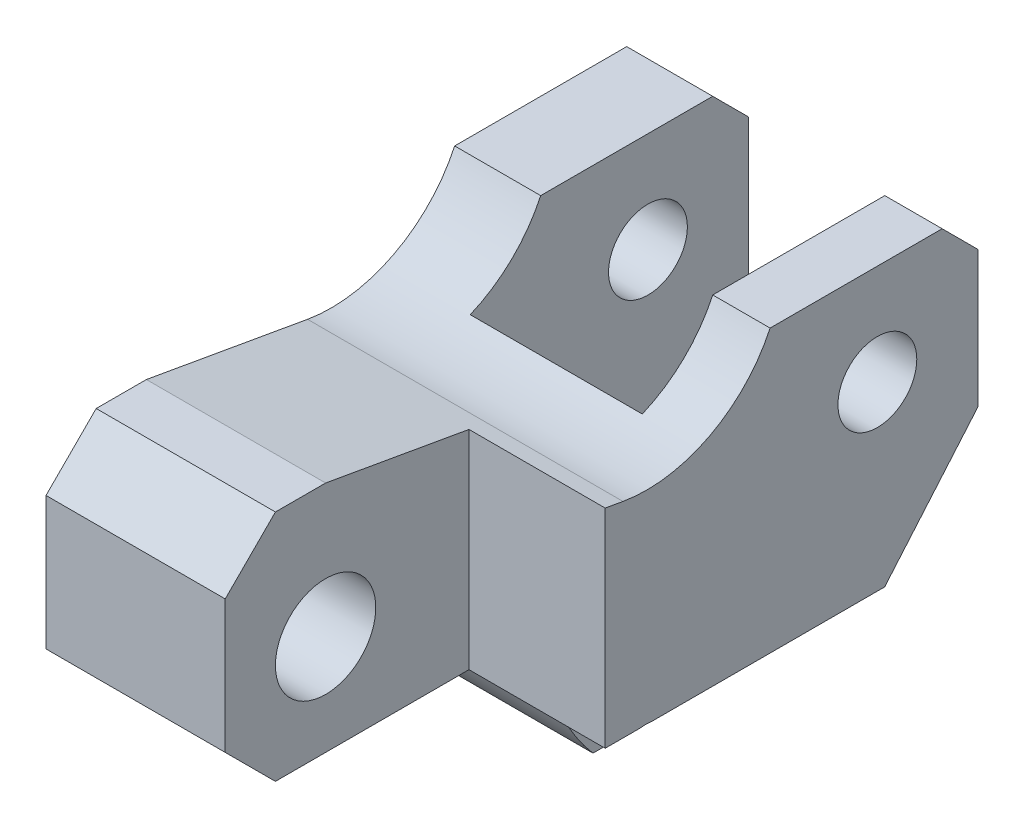
ISO-10303-21;
HEADER;
FILE_DESCRIPTION(('STEP AP214'),'2;1');
FILE_NAME('part.step','',(''),(''),'','','');
FILE_SCHEMA(('AUTOMOTIVE_DESIGN { 1 0 10303 214 1 1 1 1 }'));
ENDSEC;
DATA;
#1=APPLICATION_CONTEXT('core data for automotive mechanical design processes');
#2=APPLICATION_PROTOCOL_DEFINITION('international standard','automotive_design',2000,#1);
#3=PRODUCT_CONTEXT('',#1,'mechanical');
#4=PRODUCT('Part','Part','',(#3));
#5=PRODUCT_RELATED_PRODUCT_CATEGORY('part','',(#4));
#6=PRODUCT_DEFINITION_FORMATION('','',#4);
#7=PRODUCT_DEFINITION_CONTEXT('part definition',#1,'design');
#8=PRODUCT_DEFINITION('design','',#6,#7);
#9=PRODUCT_DEFINITION_SHAPE('','',#8);
#10=(LENGTH_UNIT() NAMED_UNIT(*) SI_UNIT(.MILLI.,.METRE.));
#11=(NAMED_UNIT(*) PLANE_ANGLE_UNIT() SI_UNIT($,.RADIAN.));
#12=(NAMED_UNIT(*) SI_UNIT($,.STERADIAN.) SOLID_ANGLE_UNIT());
#13=UNCERTAINTY_MEASURE_WITH_UNIT(LENGTH_MEASURE(1.E-05),#10,'distance_accuracy_value','');
#14=(GEOMETRIC_REPRESENTATION_CONTEXT(3) GLOBAL_UNCERTAINTY_ASSIGNED_CONTEXT((#13)) GLOBAL_UNIT_ASSIGNED_CONTEXT((#10,
#11,#12)) REPRESENTATION_CONTEXT('',''));
#15=CARTESIAN_POINT('',(0.,0.,0.));
#16=DIRECTION('',(0.,0.,1.));
#17=DIRECTION('',(1.,0.,0.));
#18=AXIS2_PLACEMENT_3D('',#15,#16,#17);
#19=CARTESIAN_POINT('',(22.,-39.,-16.2058823529412));
#20=DIRECTION('',(-1.,0.,0.));
#21=DIRECTION('',(0.,0.,1.));
#22=AXIS2_PLACEMENT_3D('',#19,#20,#21);
#23=CYLINDRICAL_SURFACE('',#22,29.);
#24=DIRECTION('',(-1.,0.,0.));
#25=VECTOR('',#24,1.);
#26=CARTESIAN_POINT('',(22.,-58.,5.70301994726546));
#27=LINE('',#26,#25);
#28=CARTESIAN_POINT('',(3.,-58.,5.70301994726546));
#29=VERTEX_POINT('',#28);
#30=CARTESIAN_POINT('',(-22.,-58.,5.70301994726546));
#31=VERTEX_POINT('',#30);
#32=EDGE_CURVE('E382',#29,#31,#27,.T.);
#33=ORIENTED_EDGE('',*,*,#32,.F.);
#34=CARTESIAN_POINT('',(3.,-39.,-16.2058823529412));
#35=DIRECTION('',(1.,0.,0.));
#36=DIRECTION('',(0.,0.,-1.));
#37=AXIS2_PLACEMENT_3D('',#34,#35,#36);
#38=CIRCLE('',#37,29.);
#39=CARTESIAN_POINT('',(3.,-43.4386963418157,12.4524144349901));
#40=VERTEX_POINT('',#39);
#41=EDGE_CURVE('E573',#29,#40,#38,.F.);
#42=ORIENTED_EDGE('',*,*,#41,.T.);
#43=DIRECTION('',(-1.,0.,0.));
#44=VECTOR('',#43,1.);
#45=CARTESIAN_POINT('',(22.,-43.4386963418157,12.4524144349901));
#46=LINE('',#45,#44);
#47=CARTESIAN_POINT('',(-22.,-43.4386963418157,12.4524144349901));
#48=VERTEX_POINT('',#47);
#49=EDGE_CURVE('E379',#40,#48,#46,.T.);
#50=ORIENTED_EDGE('',*,*,#49,.T.);
#51=CARTESIAN_POINT('',(-22.,-39.,-16.2058823529412));
#52=DIRECTION('',(-1.,0.,0.));
#53=DIRECTION('',(0.,0.,1.));
#54=AXIS2_PLACEMENT_3D('',#51,#52,#53);
#55=CIRCLE('',#54,29.);
#56=EDGE_CURVE('E332',#31,#48,#55,.T.);
#57=ORIENTED_EDGE('',*,*,#56,.F.);
#58=EDGE_LOOP('',(#33,#42,#50,#57));
#59=FACE_BOUND('',#58,.T.);
#60=ADVANCED_FACE('F99',(#59),#23,.T.);
#61=CARTESIAN_POINT('',(22.,-58.,0.));
#62=DIRECTION('',(0.,-1.,0.));
#63=DIRECTION('',(0.,0.,-1.));
#64=AXIS2_PLACEMENT_3D('',#61,#62,#63);
#65=PLANE('',#64);
#66=DIRECTION('',(-1.,0.,0.));
#67=VECTOR('',#66,1.);
#68=CARTESIAN_POINT('',(22.,-58.,0.));
#69=LINE('',#68,#67);
#70=CARTESIAN_POINT('',(3.,-58.,0.));
#71=VERTEX_POINT('',#70);
#72=CARTESIAN_POINT('',(-22.,-58.,0.));
#73=VERTEX_POINT('',#72);
#74=EDGE_CURVE('E385',#71,#73,#69,.T.);
#75=ORIENTED_EDGE('',*,*,#74,.F.);
#76=DIRECTION('',(0.,0.,1.));
#77=VECTOR('',#76,1.);
#78=CARTESIAN_POINT('',(3.,-58.,0.));
#79=LINE('',#78,#77);
#80=EDGE_CURVE('E115',#71,#29,#79,.T.);
#81=ORIENTED_EDGE('',*,*,#80,.T.);
#82=ORIENTED_EDGE('',*,*,#32,.T.);
#83=DIRECTION('',(0.,0.,1.));
#84=VECTOR('',#83,1.);
#85=CARTESIAN_POINT('',(-22.,-58.,0.));
#86=LINE('',#85,#84);
#87=EDGE_CURVE('E328',#73,#31,#86,.T.);
#88=ORIENTED_EDGE('',*,*,#87,.F.);
#89=EDGE_LOOP('',(#75,#81,#82,#88));
#90=FACE_BOUND('',#89,.T.);
#91=ADVANCED_FACE('F585',(#90),#65,.T.);
#92=CARTESIAN_POINT('',(22.,-5.,-29.));
#93=DIRECTION('',(0.,0.,-1.));
#94=DIRECTION('',(0.,1.,0.));
#95=AXIS2_PLACEMENT_3D('',#92,#93,#94);
#96=PLANE('',#95);
#97=DIRECTION('',(-1.,0.,0.));
#98=VECTOR('',#97,1.);
#99=CARTESIAN_POINT('',(22.,-5.,-29.));
#100=LINE('',#99,#98);
#101=CARTESIAN_POINT('',(-10.,-5.,-29.));
#102=VERTEX_POINT('',#101);
#103=CARTESIAN_POINT('',(-22.,-5.,-29.));
#104=VERTEX_POINT('',#103);
#105=EDGE_CURVE('E395',#102,#104,#100,.T.);
#106=ORIENTED_EDGE('',*,*,#105,.F.);
#107=DIRECTION('',(0.,-1.,0.));
#108=VECTOR('',#107,1.);
#109=CARTESIAN_POINT('',(-10.,-5.,-29.));
#110=LINE('',#109,#108);
#111=CARTESIAN_POINT('',(-10.,-24.,-29.));
#112=VERTEX_POINT('',#111);
#113=EDGE_CURVE('E464',#102,#112,#110,.T.);
#114=ORIENTED_EDGE('',*,*,#113,.T.);
#115=DIRECTION('',(-1.,0.,0.));
#116=VECTOR('',#115,1.);
#117=CARTESIAN_POINT('',(22.,-24.,-29.));
#118=LINE('',#117,#116);
#119=CARTESIAN_POINT('',(-22.,-24.,-29.));
#120=VERTEX_POINT('',#119);
#121=EDGE_CURVE('E390',#112,#120,#118,.T.);
#122=ORIENTED_EDGE('',*,*,#121,.T.);
#123=DIRECTION('',(0.,-1.,0.));
#124=VECTOR('',#123,1.);
#125=CARTESIAN_POINT('',(-22.,-5.,-29.));
#126=LINE('',#125,#124);
#127=EDGE_CURVE('E320',#104,#120,#126,.T.);
#128=ORIENTED_EDGE('',*,*,#127,.F.);
#129=EDGE_LOOP('',(#106,#114,#122,#128));
#130=FACE_BOUND('',#129,.T.);
#131=ADVANCED_FACE('F598',(#130),#96,.T.);
#132=CARTESIAN_POINT('',(22.,0.,-24.));
#133=DIRECTION('',(0.,0.707106781186546,-0.707106781186549));
#134=DIRECTION('',(0.,0.707106781186549,0.707106781186546));
#135=AXIS2_PLACEMENT_3D('',#132,#133,#134);
#136=PLANE('',#135);
#137=DIRECTION('',(-1.,0.,0.));
#138=VECTOR('',#137,1.);
#139=CARTESIAN_POINT('',(22.,0.,-24.));
#140=LINE('',#139,#138);
#141=CARTESIAN_POINT('',(-10.,0.,-24.));
#142=VERTEX_POINT('',#141);
#143=CARTESIAN_POINT('',(-22.,0.,-24.));
#144=VERTEX_POINT('',#143);
#145=EDGE_CURVE('E400',#142,#144,#140,.T.);
#146=ORIENTED_EDGE('',*,*,#145,.F.);
#147=DIRECTION('',(0.,-0.707106781186549,-0.707106781186546));
#148=VECTOR('',#147,1.);
#149=CARTESIAN_POINT('',(-10.,0.,-24.));
#150=LINE('',#149,#148);
#151=EDGE_CURVE('E460',#142,#102,#150,.T.);
#152=ORIENTED_EDGE('',*,*,#151,.T.);
#153=ORIENTED_EDGE('',*,*,#105,.T.);
#154=DIRECTION('',(0.,-0.707106781186549,-0.707106781186546));
#155=VECTOR('',#154,1.);
#156=CARTESIAN_POINT('',(-22.,0.,-24.));
#157=LINE('',#156,#155);
#158=EDGE_CURVE('E316',#144,#104,#157,.T.);
#159=ORIENTED_EDGE('',*,*,#158,.F.);
#160=EDGE_LOOP('',(#146,#152,#153,#159));
#161=FACE_BOUND('',#160,.T.);
#162=ADVANCED_FACE('F648',(#161),#136,.T.);
#163=CARTESIAN_POINT('',(22.,0.,0.));
#164=DIRECTION('',(0.,1.,0.));
#165=DIRECTION('',(0.,0.,1.));
#166=AXIS2_PLACEMENT_3D('',#163,#164,#165);
#167=PLANE('',#166);
#168=DIRECTION('',(-1.,0.,0.));
#169=VECTOR('',#168,1.);
#170=CARTESIAN_POINT('',(22.,0.,0.));
#171=LINE('',#170,#169);
#172=CARTESIAN_POINT('',(-10.,0.,0.));
#173=VERTEX_POINT('',#172);
#174=CARTESIAN_POINT('',(-22.,0.,0.));
#175=VERTEX_POINT('',#174);
#176=EDGE_CURVE('E405',#173,#175,#171,.T.);
#177=ORIENTED_EDGE('',*,*,#176,.F.);
#178=DIRECTION('',(0.,0.,-1.));
#179=VECTOR('',#178,1.);
#180=CARTESIAN_POINT('',(-10.,0.,0.));
#181=LINE('',#180,#179);
#182=EDGE_CURVE('E122',#173,#142,#181,.T.);
#183=ORIENTED_EDGE('',*,*,#182,.T.);
#184=ORIENTED_EDGE('',*,*,#145,.T.);
#185=DIRECTION('',(0.,0.,-1.));
#186=VECTOR('',#185,1.);
#187=CARTESIAN_POINT('',(-22.,0.,0.));
#188=LINE('',#187,#186);
#189=EDGE_CURVE('E312',#175,#144,#188,.T.);
#190=ORIENTED_EDGE('',*,*,#189,.F.);
#191=EDGE_LOOP('',(#177,#183,#184,#190));
#192=FACE_BOUND('',#191,.T.);
#193=ADVANCED_FACE('F605',(#192),#167,.T.);
#194=CARTESIAN_POINT('',(-24.,-14.,-14.9628500451671));
#195=DIRECTION('',(1.,0.,0.));
#196=DIRECTION('',(0.,0.,-1.));
#197=AXIS2_PLACEMENT_3D('',#194,#195,#196);
#198=CYLINDRICAL_SURFACE('',#197,5.5);
#199=CARTESIAN_POINT('',(-22.,-14.,-14.9628500451671));
#200=DIRECTION('',(1.,0.,0.));
#201=DIRECTION('',(0.,0.,-1.));
#202=AXIS2_PLACEMENT_3D('',#199,#200,#201);
#203=CIRCLE('',#202,5.5);
#204=CARTESIAN_POINT('',(-22.,-14.,-20.4628500451671));
#205=VERTEX_POINT('',#204);
#206=EDGE_CURVE('E408',#205,#205,#203,.T.);
#207=ORIENTED_EDGE('',*,*,#206,.F.);
#208=EDGE_LOOP('',(#207));
#209=FACE_BOUND('',#208,.T.);
#210=CARTESIAN_POINT('',(-10.,-14.,-14.9628500451671));
#211=DIRECTION('',(1.,0.,0.));
#212=DIRECTION('',(0.,0.,-1.));
#213=AXIS2_PLACEMENT_3D('',#210,#211,#212);
#214=CIRCLE('',#213,5.5);
#215=CARTESIAN_POINT('',(-10.,-14.,-20.4628500451671));
#216=VERTEX_POINT('',#215);
#217=EDGE_CURVE('E419',#216,#216,#214,.F.);
#218=ORIENTED_EDGE('',*,*,#217,.F.);
#219=EDGE_LOOP('',(#218));
#220=FACE_BOUND('',#219,.T.);
#221=ADVANCED_FACE('F663',(#209,#220),#198,.F.);
#222=CARTESIAN_POINT('',(22.,8.02974697307312,17.2198479536964));
#223=DIRECTION('',(1.,0.,0.));
#224=DIRECTION('',(0.,0.,-1.));
#225=AXIS2_PLACEMENT_3D('',#222,#223,#224);
#226=PLANE('',#225);
#227=DIRECTION('',(0.,0.,1.));
#228=VECTOR('',#227,1.);
#229=CARTESIAN_POINT('',(22.,-39.2629031614509,23.));
#230=LINE('',#229,#228);
#231=CARTESIAN_POINT('',(22.,-39.2629031614509,-15.9816414211154));
#232=VERTEX_POINT('',#231);
#233=CARTESIAN_POINT('',(22.,-39.2629031614509,16.6282076153549));
#234=VERTEX_POINT('',#233);
#235=EDGE_CURVE('E263',#232,#234,#230,.T.);
#236=ORIENTED_EDGE('',*,*,#235,.F.);
#237=DIRECTION('',(0.,-0.760833951959086,0.64894660608275));
#238=VECTOR('',#237,1.);
#239=CARTESIAN_POINT('',(22.,-24.,-29.));
#240=LINE('',#239,#238);
#241=CARTESIAN_POINT('',(22.,-24.,-29.));
#242=VERTEX_POINT('',#241);
#243=EDGE_CURVE('E278',#242,#232,#240,.T.);
#244=ORIENTED_EDGE('',*,*,#243,.F.);
#245=DIRECTION('',(0.,-1.,0.));
#246=VECTOR('',#245,1.);
#247=CARTESIAN_POINT('',(22.,-5.,-29.));
#248=LINE('',#247,#246);
#249=CARTESIAN_POINT('',(22.,-5.,-29.));
#250=VERTEX_POINT('',#249);
#251=EDGE_CURVE('E289',#250,#242,#248,.T.);
#252=ORIENTED_EDGE('',*,*,#251,.F.);
#253=DIRECTION('',(0.,-0.707106781186549,-0.707106781186546));
#254=VECTOR('',#253,1.);
#255=CARTESIAN_POINT('',(22.,0.,-24.));
#256=LINE('',#255,#254);
#257=CARTESIAN_POINT('',(22.,0.,-24.));
#258=VERTEX_POINT('',#257);
#259=EDGE_CURVE('E295',#258,#250,#256,.T.);
#260=ORIENTED_EDGE('',*,*,#259,.F.);
#261=DIRECTION('',(0.,0.,-1.));
#262=VECTOR('',#261,1.);
#263=CARTESIAN_POINT('',(22.,0.,0.));
#264=LINE('',#263,#262);
#265=CARTESIAN_POINT('',(22.,0.,0.));
#266=VERTEX_POINT('',#265);
#267=EDGE_CURVE('E531',#266,#258,#264,.T.);
#268=ORIENTED_EDGE('',*,*,#267,.F.);
#269=CARTESIAN_POINT('',(22.,8.02974697307312,17.2198479536964));
#270=DIRECTION('',(1.,0.,0.));
#271=DIRECTION('',(0.,0.,-1.));
#272=AXIS2_PLACEMENT_3D('',#269,#270,#271);
#273=CIRCLE('',#272,19.);
#274=CARTESIAN_POINT('',(22.,-10.6816003341589,20.519163329368));
#275=VERTEX_POINT('',#274);
#276=EDGE_CURVE('E527',#275,#266,#273,.T.);
#277=ORIENTED_EDGE('',*,*,#276,.F.);
#278=DIRECTION('',(0.,-0.173648177666924,-0.984807753012209));
#279=VECTOR('',#278,1.);
#280=CARTESIAN_POINT('',(22.,-6.71762228022635,43.));
#281=LINE('',#280,#279);
#282=CARTESIAN_POINT('',(22.,-10.2441618943955,23.));
#283=VERTEX_POINT('',#282);
#284=EDGE_CURVE('E360',#283,#275,#281,.T.);
#285=ORIENTED_EDGE('',*,*,#284,.F.);
#286=DIRECTION('',(0.,-1.,0.));
#287=VECTOR('',#286,1.);
#288=CARTESIAN_POINT('',(22.,-6.66579614244174,23.));
#289=LINE('',#288,#287);
#290=CARTESIAN_POINT('',(22.,-39.2629031614509,23.));
#291=VERTEX_POINT('',#290);
#292=EDGE_CURVE('E487',#283,#291,#289,.T.);
#293=ORIENTED_EDGE('',*,*,#292,.T.);
#294=DIRECTION('',(0.,0.,1.));
#295=VECTOR('',#294,1.);
#296=CARTESIAN_POINT('',(22.,-39.2629031614509,18.1587925608085));
#297=LINE('',#296,#295);
#298=CARTESIAN_POINT('',(22.,-39.2629031614509,18.1587925608085));
#299=VERTEX_POINT('',#298);
#300=EDGE_CURVE('E293',#299,#291,#297,.T.);
#301=ORIENTED_EDGE('',*,*,#300,.F.);
#302=CARTESIAN_POINT('',(22.,-44.2039888145425,17.3935000880817));
#303=DIRECTION('',(1.,0.,0.));
#304=DIRECTION('',(0.,0.,-1.));
#305=AXIS2_PLACEMENT_3D('',#302,#303,#304);
#306=CIRCLE('',#305,5.);
#307=EDGE_CURVE('E281',#234,#299,#306,.T.);
#308=ORIENTED_EDGE('',*,*,#307,.F.);
#309=EDGE_LOOP('',(#236,#244,#252,#260,#268,#277,#285,#293,#301,#308));
#310=FACE_BOUND('',#309,.T.);
#311=CARTESIAN_POINT('',(22.,-14.,-14.9628500451671));
#312=DIRECTION('',(1.,0.,0.));
#313=DIRECTION('',(0.,0.,-1.));
#314=AXIS2_PLACEMENT_3D('',#311,#312,#313);
#315=CIRCLE('',#314,5.5);
#316=CARTESIAN_POINT('',(22.,-14.,-20.4628500451671));
#317=VERTEX_POINT('',#316);
#318=EDGE_CURVE('E412',#317,#317,#315,.T.);
#319=ORIENTED_EDGE('',*,*,#318,.F.);
#320=EDGE_LOOP('',(#319));
#321=FACE_BOUND('',#320,.T.);
#322=ADVANCED_FACE('F275',(#310,#321),#226,.T.);
#323=CARTESIAN_POINT('',(22.,-6.71762228022635,43.));
#324=DIRECTION('',(0.,0.984807753012209,-0.173648177666924));
#325=DIRECTION('',(0.,0.173648177666924,0.984807753012209));
#326=AXIS2_PLACEMENT_3D('',#323,#324,#325);
#327=PLANE('',#326);
#328=DIRECTION('',(0.,0.173648177666924,0.984807753012209));
#329=VECTOR('',#328,1.);
#330=CARTESIAN_POINT('',(3.,-6.71762228022635,43.));
#331=LINE('',#330,#329);
#332=CARTESIAN_POINT('',(3.,-10.2441618943955,23.));
#333=VERTEX_POINT('',#332);
#334=CARTESIAN_POINT('',(3.,-6.71762228022635,43.));
#335=VERTEX_POINT('',#334);
#336=EDGE_CURVE('E512',#333,#335,#331,.T.);
#337=ORIENTED_EDGE('',*,*,#336,.F.);
#338=DIRECTION('',(1.,0.,0.));
#339=VECTOR('',#338,1.);
#340=CARTESIAN_POINT('',(22.,-10.2441618943955,23.));
#341=LINE('',#340,#339);
#342=EDGE_CURVE('E515',#333,#283,#341,.T.);
#343=ORIENTED_EDGE('',*,*,#342,.T.);
#344=ORIENTED_EDGE('',*,*,#284,.T.);
#345=DIRECTION('',(-1.,0.,0.));
#346=VECTOR('',#345,1.);
#347=CARTESIAN_POINT('',(22.,-10.6816003341589,20.519163329368));
#348=LINE('',#347,#346);
#349=CARTESIAN_POINT('',(-22.,-10.6816003341589,20.519163329368));
#350=VERTEX_POINT('',#349);
#351=EDGE_CURVE('E302',#275,#350,#348,.T.);
#352=ORIENTED_EDGE('',*,*,#351,.T.);
#353=DIRECTION('',(0.,-0.173648177666924,-0.984807753012209));
#354=VECTOR('',#353,1.);
#355=CARTESIAN_POINT('',(-22.,-6.71762228022635,43.));
#356=LINE('',#355,#354);
#357=CARTESIAN_POINT('',(-22.,-6.71762228022635,43.));
#358=VERTEX_POINT('',#357);
#359=EDGE_CURVE('E303',#358,#350,#356,.T.);
#360=ORIENTED_EDGE('',*,*,#359,.F.);
#361=DIRECTION('',(-1.,0.,0.));
#362=VECTOR('',#361,1.);
#363=CARTESIAN_POINT('',(22.,-6.71762228022635,43.));
#364=LINE('',#363,#362);
#365=EDGE_CURVE('E361',#335,#358,#364,.T.);
#366=ORIENTED_EDGE('',*,*,#365,.F.);
#367=EDGE_LOOP('',(#337,#343,#344,#352,#360,#366));
#368=FACE_BOUND('',#367,.T.);
#369=ADVANCED_FACE('F101',(#368),#327,.T.);
#370=CARTESIAN_POINT('',(22.,-39.2629031614509,18.1587925608085));
#371=DIRECTION('',(0.,-1.,0.));
#372=DIRECTION('',(0.,0.,-1.));
#373=AXIS2_PLACEMENT_3D('',#370,#371,#372);
#374=PLANE('',#373);
#375=DIRECTION('',(1.,0.,0.));
#376=VECTOR('',#375,1.);
#377=CARTESIAN_POINT('',(3.,-39.2629031614509,23.));
#378=LINE('',#377,#376);
#379=CARTESIAN_POINT('',(3.,-39.2629031614509,23.));
#380=VERTEX_POINT('',#379);
#381=EDGE_CURVE('E418',#380,#291,#378,.T.);
#382=ORIENTED_EDGE('',*,*,#381,.F.);
#383=DIRECTION('',(0.,0.,-1.));
#384=VECTOR('',#383,1.);
#385=CARTESIAN_POINT('',(3.,-39.2629031614509,57.0590779506768));
#386=LINE('',#385,#384);
#387=CARTESIAN_POINT('',(3.,-39.2629031614509,50.));
#388=VERTEX_POINT('',#387);
#389=EDGE_CURVE('E488',#388,#380,#386,.T.);
#390=ORIENTED_EDGE('',*,*,#389,.F.);
#391=DIRECTION('',(-1.,0.,0.));
#392=VECTOR('',#391,1.);
#393=CARTESIAN_POINT('',(22.,-39.2629031614509,50.));
#394=LINE('',#393,#392);
#395=CARTESIAN_POINT('',(-22.,-39.2629031614509,50.));
#396=VERTEX_POINT('',#395);
#397=EDGE_CURVE('E373',#388,#396,#394,.T.);
#398=ORIENTED_EDGE('',*,*,#397,.T.);
#399=DIRECTION('',(0.,0.,1.));
#400=VECTOR('',#399,1.);
#401=CARTESIAN_POINT('',(-22.,-39.2629031614509,18.1587925608085));
#402=LINE('',#401,#400);
#403=CARTESIAN_POINT('',(-22.,-39.2629031614509,18.1587925608085));
#404=VERTEX_POINT('',#403);
#405=EDGE_CURVE('E340',#404,#396,#402,.T.);
#406=ORIENTED_EDGE('',*,*,#405,.F.);
#407=DIRECTION('',(-1.,0.,0.));
#408=VECTOR('',#407,1.);
#409=CARTESIAN_POINT('',(22.,-39.2629031614509,18.1587925608085));
#410=LINE('',#409,#408);
#411=EDGE_CURVE('E376',#299,#404,#410,.T.);
#412=ORIENTED_EDGE('',*,*,#411,.F.);
#413=ORIENTED_EDGE('',*,*,#300,.T.);
#414=EDGE_LOOP('',(#382,#390,#398,#406,#412,#413));
#415=FACE_BOUND('',#414,.T.);
#416=ADVANCED_FACE('F562',(#415),#374,.T.);
#417=CARTESIAN_POINT('',(-22.,8.02974697307312,17.2198479536964));
#418=DIRECTION('',(1.,0.,0.));
#419=DIRECTION('',(0.,0.,-1.));
#420=AXIS2_PLACEMENT_3D('',#417,#418,#419);
#421=PLANE('',#420);
#422=ORIENTED_EDGE('',*,*,#206,.T.);
#423=EDGE_LOOP('',(#422));
#424=FACE_BOUND('',#423,.T.);
#425=ORIENTED_EDGE('',*,*,#359,.T.);
#426=CARTESIAN_POINT('',(-22.,8.02974697307312,17.2198479536964));
#427=DIRECTION('',(1.,0.,0.));
#428=DIRECTION('',(0.,0.,-1.));
#429=AXIS2_PLACEMENT_3D('',#426,#427,#428);
#430=CIRCLE('',#429,19.);
#431=EDGE_CURVE('E307',#350,#175,#430,.T.);
#432=ORIENTED_EDGE('',*,*,#431,.T.);
#433=ORIENTED_EDGE('',*,*,#189,.T.);
#434=ORIENTED_EDGE('',*,*,#158,.T.);
#435=ORIENTED_EDGE('',*,*,#127,.T.);
#436=DIRECTION('',(0.,-0.760833951959086,0.64894660608275));
#437=VECTOR('',#436,1.);
#438=CARTESIAN_POINT('',(-22.,-24.,-29.));
#439=LINE('',#438,#437);
#440=EDGE_CURVE('E324',#120,#73,#439,.T.);
#441=ORIENTED_EDGE('',*,*,#440,.T.);
#442=ORIENTED_EDGE('',*,*,#87,.T.);
#443=ORIENTED_EDGE('',*,*,#56,.T.);
#444=CARTESIAN_POINT('',(-22.,-44.2039888145425,17.3935000880817));
#445=DIRECTION('',(1.,0.,0.));
#446=DIRECTION('',(0.,0.,-1.));
#447=AXIS2_PLACEMENT_3D('',#444,#445,#446);
#448=CIRCLE('',#447,5.);
#449=EDGE_CURVE('E336',#48,#404,#448,.T.);
#450=ORIENTED_EDGE('',*,*,#449,.T.);
#451=ORIENTED_EDGE('',*,*,#405,.T.);
#452=DIRECTION('',(0.,0.707106781186549,0.707106781186546));
#453=VECTOR('',#452,1.);
#454=CARTESIAN_POINT('',(-22.,-39.2629031614509,50.));
#455=LINE('',#454,#453);
#456=CARTESIAN_POINT('',(-22.,-32.2629031614509,57.));
#457=VERTEX_POINT('',#456);
#458=EDGE_CURVE('E344',#396,#457,#455,.T.);
#459=ORIENTED_EDGE('',*,*,#458,.T.);
#460=DIRECTION('',(0.,1.,0.));
#461=VECTOR('',#460,1.);
#462=CARTESIAN_POINT('',(-22.,-32.2629031614509,57.));
#463=LINE('',#462,#461);
#464=CARTESIAN_POINT('',(-22.,-13.7176222802264,57.));
#465=VERTEX_POINT('',#464);
#466=EDGE_CURVE('E348',#457,#465,#463,.T.);
#467=ORIENTED_EDGE('',*,*,#466,.T.);
#468=DIRECTION('',(0.,0.707106781186549,-0.707106781186546));
#469=VECTOR('',#468,1.);
#470=CARTESIAN_POINT('',(-22.,-13.7176222802264,57.));
#471=LINE('',#470,#469);
#472=CARTESIAN_POINT('',(-22.,-6.71762228022635,50.));
#473=VERTEX_POINT('',#472);
#474=EDGE_CURVE('E352',#465,#473,#471,.T.);
#475=ORIENTED_EDGE('',*,*,#474,.T.);
#476=DIRECTION('',(0.,0.,1.));
#477=VECTOR('',#476,1.);
#478=CARTESIAN_POINT('',(-22.,-6.71762228022635,43.));
#479=LINE('',#478,#477);
#480=EDGE_CURVE('E356',#358,#473,#479,.T.);
#481=ORIENTED_EDGE('',*,*,#480,.F.);
#482=EDGE_LOOP('',(#425,#432,#433,#434,#435,#441,#442,#443,#450,#451,#459,#467,#475,#481));
#483=FACE_BOUND('',#482,.T.);
#484=CARTESIAN_POINT('',(-22.,-25.2629031614509,43.));
#485=DIRECTION('',(1.,0.,0.));
#486=DIRECTION('',(0.,0.,-1.));
#487=AXIS2_PLACEMENT_3D('',#484,#485,#486);
#488=CIRCLE('',#487,7.);
#489=CARTESIAN_POINT('',(-22.,-25.2629031614509,36.));
#490=VERTEX_POINT('',#489);
#491=EDGE_CURVE('E308',#490,#490,#488,.T.);
#492=ORIENTED_EDGE('',*,*,#491,.T.);
#493=EDGE_LOOP('',(#492));
#494=FACE_BOUND('',#493,.T.);
#495=ADVANCED_FACE('F593',(#424,#483,#494),#421,.F.);
#496=CARTESIAN_POINT('',(22.,-6.71762228022635,43.));
#497=DIRECTION('',(0.,-1.,0.));
#498=DIRECTION('',(0.,0.,-1.));
#499=AXIS2_PLACEMENT_3D('',#496,#497,#498);
#500=PLANE('',#499);
#501=DIRECTION('',(-1.,0.,0.));
#502=VECTOR('',#501,1.);
#503=CARTESIAN_POINT('',(22.,-6.71762228022635,50.));
#504=LINE('',#503,#502);
#505=CARTESIAN_POINT('',(3.,-6.71762228022635,50.));
#506=VERTEX_POINT('',#505);
#507=EDGE_CURVE('E364',#506,#473,#504,.T.);
#508=ORIENTED_EDGE('',*,*,#507,.F.);
#509=DIRECTION('',(0.,0.,-1.));
#510=VECTOR('',#509,1.);
#511=CARTESIAN_POINT('',(3.,-6.71762228022635,43.));
#512=LINE('',#511,#510);
#513=EDGE_CURVE('E508',#506,#335,#512,.T.);
#514=ORIENTED_EDGE('',*,*,#513,.T.);
#515=ORIENTED_EDGE('',*,*,#365,.T.);
#516=ORIENTED_EDGE('',*,*,#480,.T.);
#517=EDGE_LOOP('',(#508,#514,#515,#516));
#518=FACE_BOUND('',#517,.T.);
#519=ADVANCED_FACE('F610',(#518),#500,.F.);
#520=CARTESIAN_POINT('',(22.,-13.7176222802264,57.));
#521=DIRECTION('',(0.,0.707106781186546,0.707106781186549));
#522=DIRECTION('',(0.,-0.707106781186549,0.707106781186546));
#523=AXIS2_PLACEMENT_3D('',#520,#521,#522);
#524=PLANE('',#523);
#525=DIRECTION('',(0.,-0.707106781186549,0.707106781186546));
#526=VECTOR('',#525,1.);
#527=CARTESIAN_POINT('',(3.,-13.7176222802264,57.));
#528=LINE('',#527,#526);
#529=CARTESIAN_POINT('',(3.,-13.7176222802264,57.));
#530=VERTEX_POINT('',#529);
#531=EDGE_CURVE('E505',#506,#530,#528,.T.);
#532=ORIENTED_EDGE('',*,*,#531,.F.);
#533=ORIENTED_EDGE('',*,*,#507,.T.);
#534=ORIENTED_EDGE('',*,*,#474,.F.);
#535=DIRECTION('',(-1.,0.,0.));
#536=VECTOR('',#535,1.);
#537=CARTESIAN_POINT('',(22.,-13.7176222802264,57.));
#538=LINE('',#537,#536);
#539=EDGE_CURVE('E367',#530,#465,#538,.T.);
#540=ORIENTED_EDGE('',*,*,#539,.F.);
#541=EDGE_LOOP('',(#532,#533,#534,#540));
#542=FACE_BOUND('',#541,.T.);
#543=ADVANCED_FACE('F615',(#542),#524,.T.);
#544=CARTESIAN_POINT('',(22.,-32.2629031614509,57.));
#545=DIRECTION('',(0.,0.,1.));
#546=DIRECTION('',(0.,-1.,0.));
#547=AXIS2_PLACEMENT_3D('',#544,#545,#546);
#548=PLANE('',#547);
#549=DIRECTION('',(0.,-1.,0.));
#550=VECTOR('',#549,1.);
#551=CARTESIAN_POINT('',(3.,-32.2629031614509,57.));
#552=LINE('',#551,#550);
#553=CARTESIAN_POINT('',(3.,-32.2629031614509,57.));
#554=VERTEX_POINT('',#553);
#555=EDGE_CURVE('E502',#530,#554,#552,.T.);
#556=ORIENTED_EDGE('',*,*,#555,.F.);
#557=ORIENTED_EDGE('',*,*,#539,.T.);
#558=ORIENTED_EDGE('',*,*,#466,.F.);
#559=DIRECTION('',(-1.,0.,0.));
#560=VECTOR('',#559,1.);
#561=CARTESIAN_POINT('',(22.,-32.2629031614509,57.));
#562=LINE('',#561,#560);
#563=EDGE_CURVE('E370',#554,#457,#562,.T.);
#564=ORIENTED_EDGE('',*,*,#563,.F.);
#565=EDGE_LOOP('',(#556,#557,#558,#564));
#566=FACE_BOUND('',#565,.T.);
#567=ADVANCED_FACE('F619',(#566),#548,.T.);
#568=CARTESIAN_POINT('',(22.,-39.2629031614509,50.));
#569=DIRECTION('',(0.,-0.707106781186547,0.707106781186549));
#570=DIRECTION('',(0.,-0.707106781186549,-0.707106781186546));
#571=AXIS2_PLACEMENT_3D('',#568,#569,#570);
#572=PLANE('',#571);
#573=DIRECTION('',(0.,-0.707106781186549,-0.707106781186546));
#574=VECTOR('',#573,1.);
#575=CARTESIAN_POINT('',(3.,-39.2629031614509,50.));
#576=LINE('',#575,#574);
#577=EDGE_CURVE('E417',#554,#388,#576,.T.);
#578=ORIENTED_EDGE('',*,*,#577,.F.);
#579=ORIENTED_EDGE('',*,*,#563,.T.);
#580=ORIENTED_EDGE('',*,*,#458,.F.);
#581=ORIENTED_EDGE('',*,*,#397,.F.);
#582=EDGE_LOOP('',(#578,#579,#580,#581));
#583=FACE_BOUND('',#582,.T.);
#584=ADVANCED_FACE('F622',(#583),#572,.T.);
#585=CARTESIAN_POINT('',(22.,-44.2039888145425,17.3935000880817));
#586=DIRECTION('',(-1.,0.,0.));
#587=DIRECTION('',(0.,0.,1.));
#588=AXIS2_PLACEMENT_3D('',#585,#586,#587);
#589=CYLINDRICAL_SURFACE('',#588,5.);
#590=DIRECTION('',(-1.,0.,0.));
#591=VECTOR('',#590,1.);
#592=CARTESIAN_POINT('',(22.,-39.2629031614509,16.6282076153549));
#593=LINE('',#592,#591);
#594=CARTESIAN_POINT('',(3.,-39.2629031614509,16.6282076153549));
#595=VERTEX_POINT('',#594);
#596=EDGE_CURVE('E270',#234,#595,#593,.T.);
#597=ORIENTED_EDGE('',*,*,#596,.F.);
#598=ORIENTED_EDGE('',*,*,#307,.T.);
#599=ORIENTED_EDGE('',*,*,#411,.T.);
#600=ORIENTED_EDGE('',*,*,#449,.F.);
#601=ORIENTED_EDGE('',*,*,#49,.F.);
#602=CARTESIAN_POINT('',(3.,-44.2039888145425,17.3935000880817));
#603=DIRECTION('',(1.,0.,0.));
#604=DIRECTION('',(0.,0.,-1.));
#605=AXIS2_PLACEMENT_3D('',#602,#603,#604);
#606=CIRCLE('',#605,5.);
#607=EDGE_CURVE('E452',#40,#595,#606,.T.);
#608=ORIENTED_EDGE('',*,*,#607,.T.);
#609=EDGE_LOOP('',(#597,#598,#599,#600,#601,#608));
#610=FACE_BOUND('',#609,.T.);
#611=ADVANCED_FACE('F567',(#610),#589,.F.);
#612=CARTESIAN_POINT('',(22.,-24.,-29.));
#613=DIRECTION('',(0.,-0.64894660608275,-0.760833951959086));
#614=DIRECTION('',(0.,0.760833951959086,-0.64894660608275));
#615=AXIS2_PLACEMENT_3D('',#612,#613,#614);
#616=PLANE('',#615);
#617=DIRECTION('',(1.,0.,0.));
#618=VECTOR('',#617,1.);
#619=CARTESIAN_POINT('',(22.,-39.2629031614509,-15.9816414211154));
#620=LINE('',#619,#618);
#621=CARTESIAN_POINT('',(3.,-39.2629031614509,-15.9816414211154));
#622=VERTEX_POINT('',#621);
#623=EDGE_CURVE('E260',#622,#232,#620,.T.);
#624=ORIENTED_EDGE('',*,*,#623,.F.);
#625=DIRECTION('',(0.,-0.760833951959086,0.64894660608275));
#626=VECTOR('',#625,1.);
#627=CARTESIAN_POINT('',(3.,-24.,-29.));
#628=LINE('',#627,#626);
#629=EDGE_CURVE('E12',#622,#71,#628,.T.);
#630=ORIENTED_EDGE('',*,*,#629,.T.);
#631=ORIENTED_EDGE('',*,*,#74,.T.);
#632=ORIENTED_EDGE('',*,*,#440,.F.);
#633=ORIENTED_EDGE('',*,*,#121,.F.);
#634=DIRECTION('',(0.,-0.760833951959086,0.64894660608275));
#635=VECTOR('',#634,1.);
#636=CARTESIAN_POINT('',(-10.,-24.,-29.));
#637=LINE('',#636,#635);
#638=CARTESIAN_POINT('',(-10.,-36.,-18.7647058823529));
#639=VERTEX_POINT('',#638);
#640=EDGE_CURVE('E429',#112,#639,#637,.T.);
#641=ORIENTED_EDGE('',*,*,#640,.T.);
#642=DIRECTION('',(-1.,0.,0.));
#643=VECTOR('',#642,1.);
#644=CARTESIAN_POINT('',(14.,-36.,-18.7647058823529));
#645=LINE('',#644,#643);
#646=CARTESIAN_POINT('',(14.,-36.,-18.7647058823529));
#647=VERTEX_POINT('',#646);
#648=EDGE_CURVE('E484',#639,#647,#645,.F.);
#649=ORIENTED_EDGE('',*,*,#648,.T.);
#650=DIRECTION('',(0.,-0.760833951959086,0.64894660608275));
#651=VECTOR('',#650,1.);
#652=CARTESIAN_POINT('',(14.,-24.,-29.));
#653=LINE('',#652,#651);
#654=CARTESIAN_POINT('',(14.,-24.,-29.));
#655=VERTEX_POINT('',#654);
#656=EDGE_CURVE('E448',#655,#647,#653,.T.);
#657=ORIENTED_EDGE('',*,*,#656,.F.);
#658=EDGE_CURVE('E287',#242,#655,#118,.T.);
#659=ORIENTED_EDGE('',*,*,#658,.F.);
#660=ORIENTED_EDGE('',*,*,#243,.T.);
#661=EDGE_LOOP('',(#624,#630,#631,#632,#633,#641,#649,#657,#659,#660));
#662=FACE_BOUND('',#661,.T.);
#663=ADVANCED_FACE('F284',(#662),#616,.T.);
#664=DIRECTION('',(0.,-1.,0.));
#665=VECTOR('',#664,1.);
#666=CARTESIAN_POINT('',(14.,-5.,-29.));
#667=LINE('',#666,#665);
#668=CARTESIAN_POINT('',(14.,-5.,-29.));
#669=VERTEX_POINT('',#668);
#670=EDGE_CURVE('E479',#669,#655,#667,.T.);
#671=ORIENTED_EDGE('',*,*,#670,.F.);
#672=EDGE_CURVE('E391',#250,#669,#100,.T.);
#673=ORIENTED_EDGE('',*,*,#672,.F.);
#674=ORIENTED_EDGE('',*,*,#251,.T.);
#675=ORIENTED_EDGE('',*,*,#658,.T.);
#676=EDGE_LOOP('',(#671,#673,#674,#675));
#677=FACE_BOUND('',#676,.T.);
#678=ADVANCED_FACE('F642',(#677),#96,.T.);
#679=DIRECTION('',(0.,-0.707106781186549,-0.707106781186546));
#680=VECTOR('',#679,1.);
#681=CARTESIAN_POINT('',(14.,0.,-24.));
#682=LINE('',#681,#680);
#683=CARTESIAN_POINT('',(14.,0.,-24.));
#684=VERTEX_POINT('',#683);
#685=EDGE_CURVE('E476',#684,#669,#682,.T.);
#686=ORIENTED_EDGE('',*,*,#685,.F.);
#687=EDGE_CURVE('E396',#258,#684,#140,.T.);
#688=ORIENTED_EDGE('',*,*,#687,.F.);
#689=ORIENTED_EDGE('',*,*,#259,.T.);
#690=ORIENTED_EDGE('',*,*,#672,.T.);
#691=EDGE_LOOP('',(#686,#688,#689,#690));
#692=FACE_BOUND('',#691,.T.);
#693=ADVANCED_FACE('F539',(#692),#136,.T.);
#694=DIRECTION('',(0.,0.,-1.));
#695=VECTOR('',#694,1.);
#696=CARTESIAN_POINT('',(14.,0.,0.));
#697=LINE('',#696,#695);
#698=CARTESIAN_POINT('',(14.,0.,0.));
#699=VERTEX_POINT('',#698);
#700=EDGE_CURVE('E473',#699,#684,#697,.T.);
#701=ORIENTED_EDGE('',*,*,#700,.F.);
#702=EDGE_CURVE('E401',#266,#699,#171,.T.);
#703=ORIENTED_EDGE('',*,*,#702,.F.);
#704=ORIENTED_EDGE('',*,*,#267,.T.);
#705=ORIENTED_EDGE('',*,*,#687,.T.);
#706=EDGE_LOOP('',(#701,#703,#704,#705));
#707=FACE_BOUND('',#706,.T.);
#708=ADVANCED_FACE('F543',(#707),#167,.T.);
#709=CARTESIAN_POINT('',(22.,8.02974697307312,17.2198479536964));
#710=DIRECTION('',(-1.,0.,0.));
#711=DIRECTION('',(0.,0.,1.));
#712=AXIS2_PLACEMENT_3D('',#709,#710,#711);
#713=CYLINDRICAL_SURFACE('',#712,19.);
#714=CARTESIAN_POINT('',(14.,8.02974697307312,17.2198479536964));
#715=DIRECTION('',(1.,0.,0.));
#716=DIRECTION('',(0.,0.,-1.));
#717=AXIS2_PLACEMENT_3D('',#714,#715,#716);
#718=CIRCLE('',#717,19.);
#719=CARTESIAN_POINT('',(14.,-9.47245250433327,9.8257277590366));
#720=VERTEX_POINT('',#719);
#721=EDGE_CURVE('E428',#720,#699,#718,.T.);
#722=ORIENTED_EDGE('',*,*,#721,.F.);
#723=DIRECTION('',(-1.,0.,0.));
#724=VECTOR('',#723,1.);
#725=CARTESIAN_POINT('',(2.,-9.47245250433326,9.8257277590366));
#726=LINE('',#725,#724);
#727=CARTESIAN_POINT('',(-10.,-9.47245250433327,9.8257277590366));
#728=VERTEX_POINT('',#727);
#729=EDGE_CURVE('E108',#720,#728,#726,.T.);
#730=ORIENTED_EDGE('',*,*,#729,.T.);
#731=CARTESIAN_POINT('',(-10.,8.02974697307312,17.2198479536964));
#732=DIRECTION('',(1.,0.,0.));
#733=DIRECTION('',(0.,0.,-1.));
#734=AXIS2_PLACEMENT_3D('',#731,#732,#733);
#735=CIRCLE('',#734,19.);
#736=EDGE_CURVE('E423',#728,#173,#735,.T.);
#737=ORIENTED_EDGE('',*,*,#736,.T.);
#738=ORIENTED_EDGE('',*,*,#176,.T.);
#739=ORIENTED_EDGE('',*,*,#431,.F.);
#740=ORIENTED_EDGE('',*,*,#351,.F.);
#741=ORIENTED_EDGE('',*,*,#276,.T.);
#742=ORIENTED_EDGE('',*,*,#702,.T.);
#743=EDGE_LOOP('',(#722,#730,#737,#738,#739,#740,#741,#742));
#744=FACE_BOUND('',#743,.T.);
#745=ADVANCED_FACE('F434',(#744),#713,.F.);
#746=CARTESIAN_POINT('',(22.,-25.2629031614509,43.));
#747=DIRECTION('',(-1.,0.,0.));
#748=DIRECTION('',(0.,0.,1.));
#749=AXIS2_PLACEMENT_3D('',#746,#747,#748);
#750=CYLINDRICAL_SURFACE('',#749,7.);
#751=CARTESIAN_POINT('',(3.,-25.2629031614509,43.));
#752=DIRECTION('',(-1.,0.,0.));
#753=DIRECTION('',(0.,0.,1.));
#754=AXIS2_PLACEMENT_3D('',#751,#752,#753);
#755=CIRCLE('',#754,7.);
#756=CARTESIAN_POINT('',(3.,-25.2629031614509,50.));
#757=VERTEX_POINT('',#756);
#758=EDGE_CURVE('E413',#757,#757,#755,.T.);
#759=ORIENTED_EDGE('',*,*,#758,.F.);
#760=EDGE_LOOP('',(#759));
#761=FACE_BOUND('',#760,.T.);
#762=ORIENTED_EDGE('',*,*,#491,.F.);
#763=EDGE_LOOP('',(#762));
#764=FACE_BOUND('',#763,.T.);
#765=ADVANCED_FACE('F651',(#761,#764),#750,.F.);
#766=CARTESIAN_POINT('',(14.,-14.,-14.9628500451671));
#767=DIRECTION('',(1.,0.,0.));
#768=DIRECTION('',(0.,0.,-1.));
#769=AXIS2_PLACEMENT_3D('',#766,#767,#768);
#770=CIRCLE('',#769,5.5);
#771=CARTESIAN_POINT('',(14.,-14.,-20.4628500451671));
#772=VERTEX_POINT('',#771);
#773=EDGE_CURVE('E425',#772,#772,#770,.F.);
#774=ORIENTED_EDGE('',*,*,#773,.T.);
#775=EDGE_LOOP('',(#774));
#776=FACE_BOUND('',#775,.T.);
#777=ORIENTED_EDGE('',*,*,#318,.T.);
#778=EDGE_LOOP('',(#777));
#779=FACE_BOUND('',#778,.T.);
#780=ADVANCED_FACE('F655',(#776,#779),#198,.F.);
#781=CARTESIAN_POINT('',(3.,-6.66579614244174,23.));
#782=DIRECTION('',(0.,0.,1.));
#783=DIRECTION('',(0.,-1.,0.));
#784=AXIS2_PLACEMENT_3D('',#781,#782,#783);
#785=PLANE('',#784);
#786=DIRECTION('',(0.,-1.,0.));
#787=VECTOR('',#786,1.);
#788=CARTESIAN_POINT('',(3.,-6.66579614244174,23.));
#789=LINE('',#788,#787);
#790=EDGE_CURVE('E492',#333,#380,#789,.T.);
#791=ORIENTED_EDGE('',*,*,#790,.T.);
#792=ORIENTED_EDGE('',*,*,#381,.T.);
#793=ORIENTED_EDGE('',*,*,#292,.F.);
#794=ORIENTED_EDGE('',*,*,#342,.F.);
#795=EDGE_LOOP('',(#791,#792,#793,#794));
#796=FACE_BOUND('',#795,.T.);
#797=ADVANCED_FACE('F553',(#796),#785,.T.);
#798=CARTESIAN_POINT('',(3.,0.,0.));
#799=DIRECTION('',(-1.,0.,0.));
#800=DIRECTION('',(0.,0.,1.));
#801=AXIS2_PLACEMENT_3D('',#798,#799,#800);
#802=PLANE('',#801);
#803=ORIENTED_EDGE('',*,*,#336,.T.);
#804=ORIENTED_EDGE('',*,*,#513,.F.);
#805=ORIENTED_EDGE('',*,*,#531,.T.);
#806=ORIENTED_EDGE('',*,*,#555,.T.);
#807=ORIENTED_EDGE('',*,*,#577,.T.);
#808=ORIENTED_EDGE('',*,*,#389,.T.);
#809=ORIENTED_EDGE('',*,*,#790,.F.);
#810=EDGE_LOOP('',(#803,#804,#805,#806,#807,#808,#809));
#811=FACE_BOUND('',#810,.T.);
#812=ORIENTED_EDGE('',*,*,#758,.T.);
#813=EDGE_LOOP('',(#812));
#814=FACE_BOUND('',#813,.T.);
#815=ADVANCED_FACE('F555',(#811,#814),#802,.F.);
#816=CARTESIAN_POINT('',(14.,3.70187343596345,-29.));
#817=DIRECTION('',(1.,0.,0.));
#818=DIRECTION('',(0.,0.,-1.));
#819=AXIS2_PLACEMENT_3D('',#816,#817,#818);
#820=PLANE('',#819);
#821=ORIENTED_EDGE('',*,*,#656,.T.);
#822=CARTESIAN_POINT('',(14.,3.70187343596345,-29.));
#823=DIRECTION('',(1.,0.,0.));
#824=DIRECTION('',(0.,0.,-1.));
#825=AXIS2_PLACEMENT_3D('',#822,#823,#824);
#826=CIRCLE('',#825,41.);
#827=EDGE_CURVE('E424',#720,#647,#826,.T.);
#828=ORIENTED_EDGE('',*,*,#827,.F.);
#829=ORIENTED_EDGE('',*,*,#721,.T.);
#830=ORIENTED_EDGE('',*,*,#700,.T.);
#831=ORIENTED_EDGE('',*,*,#685,.T.);
#832=ORIENTED_EDGE('',*,*,#670,.T.);
#833=EDGE_LOOP('',(#821,#828,#829,#830,#831,#832));
#834=FACE_BOUND('',#833,.T.);
#835=ORIENTED_EDGE('',*,*,#773,.F.);
#836=EDGE_LOOP('',(#835));
#837=FACE_BOUND('',#836,.T.);
#838=ADVANCED_FACE('F445',(#834,#837),#820,.F.);
#839=CARTESIAN_POINT('',(-10.,3.70187343596345,-29.));
#840=DIRECTION('',(1.,0.,0.));
#841=DIRECTION('',(0.,0.,-1.));
#842=AXIS2_PLACEMENT_3D('',#839,#840,#841);
#843=PLANE('',#842);
#844=ORIENTED_EDGE('',*,*,#113,.F.);
#845=ORIENTED_EDGE('',*,*,#151,.F.);
#846=ORIENTED_EDGE('',*,*,#182,.F.);
#847=ORIENTED_EDGE('',*,*,#736,.F.);
#848=CARTESIAN_POINT('',(-10.,3.70187343596345,-29.));
#849=DIRECTION('',(1.,0.,0.));
#850=DIRECTION('',(0.,0.,-1.));
#851=AXIS2_PLACEMENT_3D('',#848,#849,#850);
#852=CIRCLE('',#851,41.);
#853=EDGE_CURVE('E443',#728,#639,#852,.T.);
#854=ORIENTED_EDGE('',*,*,#853,.T.);
#855=ORIENTED_EDGE('',*,*,#640,.F.);
#856=EDGE_LOOP('',(#844,#845,#846,#847,#854,#855));
#857=FACE_BOUND('',#856,.T.);
#858=ORIENTED_EDGE('',*,*,#217,.T.);
#859=EDGE_LOOP('',(#858));
#860=FACE_BOUND('',#859,.T.);
#861=ADVANCED_FACE('F898',(#857,#860),#843,.T.);
#862=CARTESIAN_POINT('',(14.,3.70187343596345,-29.));
#863=DIRECTION('',(-1.,0.,0.));
#864=DIRECTION('',(0.,0.,1.));
#865=AXIS2_PLACEMENT_3D('',#862,#863,#864);
#866=CYLINDRICAL_SURFACE('',#865,41.);
#867=ORIENTED_EDGE('',*,*,#853,.F.);
#868=ORIENTED_EDGE('',*,*,#729,.F.);
#869=ORIENTED_EDGE('',*,*,#827,.T.);
#870=ORIENTED_EDGE('',*,*,#648,.F.);
#871=EDGE_LOOP('',(#867,#868,#869,#870));
#872=FACE_BOUND('',#871,.T.);
#873=ADVANCED_FACE('F440',(#872),#866,.F.);
#874=CARTESIAN_POINT('',(3.,-39.2629031614509,23.));
#875=DIRECTION('',(0.,1.,0.));
#876=DIRECTION('',(0.,0.,1.));
#877=AXIS2_PLACEMENT_3D('',#874,#875,#876);
#878=PLANE('',#877);
#879=ORIENTED_EDGE('',*,*,#596,.T.);
#880=DIRECTION('',(0.,0.,1.));
#881=VECTOR('',#880,1.);
#882=CARTESIAN_POINT('',(3.,-39.2629031614509,23.));
#883=LINE('',#882,#881);
#884=EDGE_CURVE('E266',#622,#595,#883,.T.);
#885=ORIENTED_EDGE('',*,*,#884,.F.);
#886=ORIENTED_EDGE('',*,*,#623,.T.);
#887=ORIENTED_EDGE('',*,*,#235,.T.);
#888=EDGE_LOOP('',(#879,#885,#886,#887));
#889=FACE_BOUND('',#888,.T.);
#890=ADVANCED_FACE('F262',(#889),#878,.F.);
#891=CARTESIAN_POINT('',(3.,0.,0.));
#892=DIRECTION('',(1.,0.,0.));
#893=DIRECTION('',(0.,0.,-1.));
#894=AXIS2_PLACEMENT_3D('',#891,#892,#893);
#895=PLANE('',#894);
#896=ORIENTED_EDGE('',*,*,#41,.F.);
#897=ORIENTED_EDGE('',*,*,#80,.F.);
#898=ORIENTED_EDGE('',*,*,#629,.F.);
#899=ORIENTED_EDGE('',*,*,#884,.T.);
#900=ORIENTED_EDGE('',*,*,#607,.F.);
#901=EDGE_LOOP('',(#896,#897,#898,#899,#900));
#902=FACE_BOUND('',#901,.T.);
#903=ADVANCED_FACE('F582',(#902),#895,.T.);
#904=CLOSED_SHELL('',(#60,#91,#131,#162,#193,#221,#322,#369,#416,#495,#519,#543,#567,#584,#611,
#663,#678,#693,#708,#745,#765,#780,#797,#815,#838,#861,#873,#890,#903));
#905=MANIFOLD_SOLID_BREP('B2',#904);
#906=ADVANCED_BREP_SHAPE_REPRESENTATION('',(#18,#905),#14);
#907=SHAPE_DEFINITION_REPRESENTATION(#9,#906);
ENDSEC;
END-ISO-10303-21;
